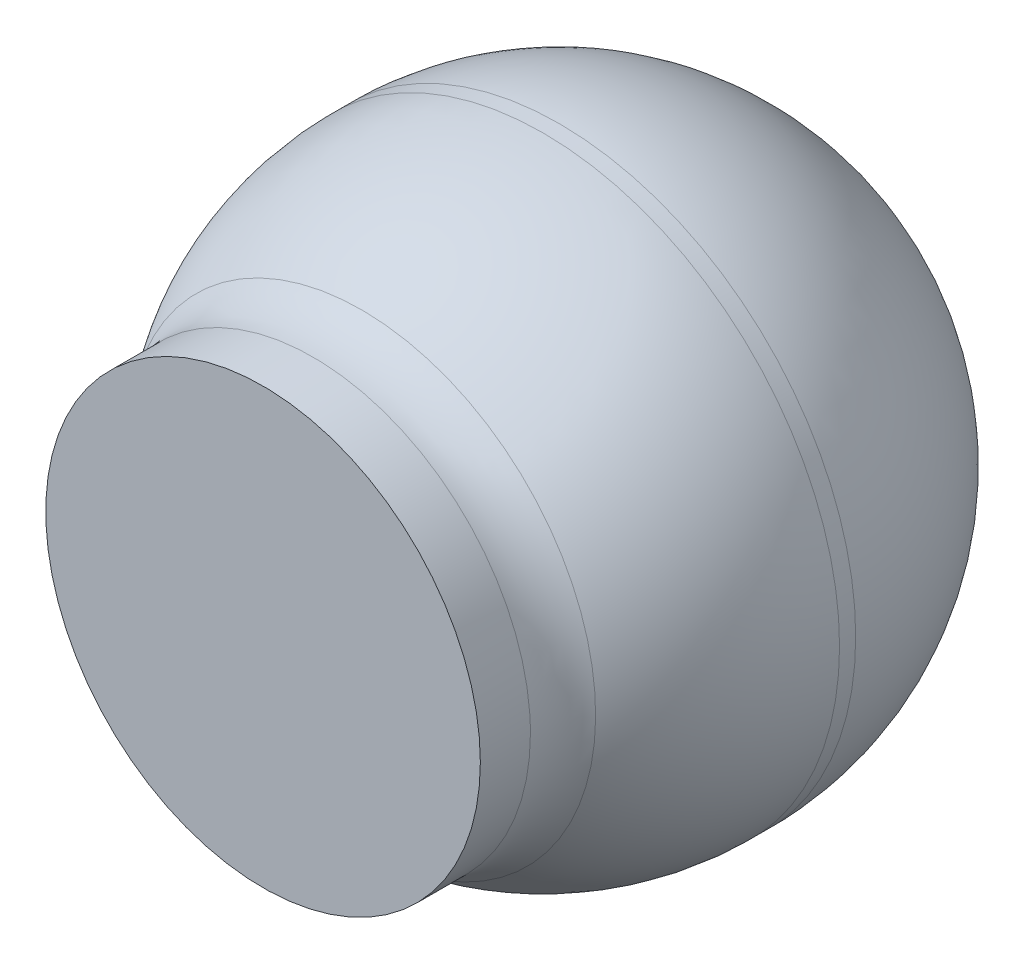
ISO-10303-21;
HEADER;
FILE_DESCRIPTION(('STEP AP214'),'2;1');
FILE_NAME('part.step','',(''),(''),'','','');
FILE_SCHEMA(('AUTOMOTIVE_DESIGN { 1 0 10303 214 1 1 1 1 }'));
ENDSEC;
DATA;
#1=APPLICATION_CONTEXT('core data for automotive mechanical design processes');
#2=APPLICATION_PROTOCOL_DEFINITION('international standard','automotive_design',2000,#1);
#3=PRODUCT_CONTEXT('',#1,'mechanical');
#4=PRODUCT('Part','Part','',(#3));
#5=PRODUCT_RELATED_PRODUCT_CATEGORY('part','',(#4));
#6=PRODUCT_DEFINITION_FORMATION('','',#4);
#7=PRODUCT_DEFINITION_CONTEXT('part definition',#1,'design');
#8=PRODUCT_DEFINITION('design','',#6,#7);
#9=PRODUCT_DEFINITION_SHAPE('','',#8);
#10=(LENGTH_UNIT() NAMED_UNIT(*) SI_UNIT(.MILLI.,.METRE.));
#11=(NAMED_UNIT(*) PLANE_ANGLE_UNIT() SI_UNIT($,.RADIAN.));
#12=(NAMED_UNIT(*) SI_UNIT($,.STERADIAN.) SOLID_ANGLE_UNIT());
#13=UNCERTAINTY_MEASURE_WITH_UNIT(LENGTH_MEASURE(1.E-05),#10,'distance_accuracy_value','');
#14=(GEOMETRIC_REPRESENTATION_CONTEXT(3) GLOBAL_UNCERTAINTY_ASSIGNED_CONTEXT((#13)) GLOBAL_UNIT_ASSIGNED_CONTEXT((#10,
#11,#12)) REPRESENTATION_CONTEXT('',''));
#15=CARTESIAN_POINT('',(0.,0.,0.));
#16=DIRECTION('',(0.,0.,1.));
#17=DIRECTION('',(1.,0.,0.));
#18=AXIS2_PLACEMENT_3D('',#15,#16,#17);
#19=CARTESIAN_POINT('',(-8.182919922269,-1.511349291452,10.006534503384));
#20=DIRECTION('',(0.,0.,-1.));
#21=DIRECTION('',(-1.,0.,0.));
#22=AXIS2_PLACEMENT_3D('',#19,#20,#21);
#23=PLANE('',#22);
#24=CARTESIAN_POINT('',(-8.182919922269,-1.511349291452,10.006534503384));
#25=DIRECTION('',(0.,0.,1.));
#26=DIRECTION('',(1.,0.,0.));
#27=AXIS2_PLACEMENT_3D('',#24,#25,#26);
#28=CIRCLE('',#27,0.275);
#29=CARTESIAN_POINT('',(-7.907919922269,-1.511349291452,10.006534503384));
#30=VERTEX_POINT('',#29);
#31=EDGE_CURVE('E20',#30,#30,#28,.F.);
#32=ORIENTED_EDGE('',*,*,#31,.F.);
#33=EDGE_LOOP('',(#32));
#34=FACE_BOUND('',#33,.T.);
#35=ADVANCED_FACE('F17',(#34),#23,.F.);
#36=CARTESIAN_POINT('',(-8.182919922269,-1.511349291452,9.906534503384));
#37=DIRECTION('',(0.,0.,1.));
#38=DIRECTION('',(1.,0.,0.));
#39=AXIS2_PLACEMENT_3D('',#36,#37,#38);
#40=CYLINDRICAL_SURFACE('',#39,0.275);
#41=CARTESIAN_POINT('',(-8.182919922269,-1.511349291452,9.943180457728));
#42=DIRECTION('',(0.,0.,-1.));
#43=DIRECTION('',(0.996700902337582,0.081162252799246,0.));
#44=AXIS2_PLACEMENT_3D('',#41,#42,#43);
#45=CIRCLE('',#44,0.275000000000001);
#46=CARTESIAN_POINT('',(-7.90882717412616,-1.48902967193221,9.943180457728));
#47=VERTEX_POINT('',#46);
#48=EDGE_CURVE('E65',#47,#47,#45,.F.);
#49=ORIENTED_EDGE('',*,*,#48,.T.);
#50=EDGE_LOOP('',(#49));
#51=FACE_BOUND('',#50,.T.);
#52=ORIENTED_EDGE('',*,*,#31,.T.);
#53=EDGE_LOOP('',(#52));
#54=FACE_BOUND('',#53,.T.);
#55=ADVANCED_FACE('F62',(#51,#54),#40,.T.);
#56=CARTESIAN_POINT('',(-8.182919922269,-1.511349291452,9.943180457728));
#57=DIRECTION('',(0.,0.,-1.));
#58=DIRECTION('',(0.996700902337583,0.081162252799246,0.));
#59=AXIS2_PLACEMENT_3D('',#56,#57,#58);
#60=TOROIDAL_SURFACE('',#59,0.375,0.1);
#61=ORIENTED_EDGE('',*,*,#48,.F.);
#62=EDGE_LOOP('',(#61));
#63=FACE_BOUND('',#62,.T.);
#64=CARTESIAN_POINT('',(-8.182919922269,-1.511349291452,9.881744931236));
#65=DIRECTION('',(0.,0.,-1.));
#66=DIRECTION('',(-0.996700902337597,-0.081162252799062,0.));
#67=AXIS2_PLACEMENT_3D('',#64,#65,#66);
#68=CIRCLE('',#67,0.296097046412663);
#69=CARTESIAN_POINT('',(-8.478040115608,-1.535381194786,9.881744931236));
#70=VERTEX_POINT('',#69);
#71=EDGE_CURVE('E39',#70,#70,#68,.T.);
#72=ORIENTED_EDGE('',*,*,#71,.F.);
#73=EDGE_LOOP('',(#72));
#74=FACE_BOUND('',#73,.T.);
#75=ADVANCED_FACE('F57',(#63,#74),#60,.F.);
#76=CARTESIAN_POINT('',(-8.556682760645,-1.541785136252,9.651976062157));
#77=CARTESIAN_POINT('',(-8.556682760645,-1.541785136252,9.701461392103));
#78=CARTESIAN_POINT('',(-8.548526217348,-1.541120941579,9.750947004335));
#79=CARTESIAN_POINT('',(-8.532207085349,-1.539792059952,9.798626332798));
#80=CARTESIAN_POINT('',(-8.508341390838,-1.537848654938,9.842699544317));
#81=CARTESIAN_POINT('',(-8.478040115608,-1.535381194786,9.881744931236));
#82=(BOUNDED_CURVE() B_SPLINE_CURVE(5,(#76,#77,#78,#79,#80,#81),.UNSPECIFIED.,.F.,
.F.) B_SPLINE_CURVE_WITH_KNOTS((6,6),(0.,0.661568582165),
.UNSPECIFIED.) CURVE() GEOMETRIC_REPRESENTATION_ITEM() RATIONAL_B_SPLINE_CURVE((1.,1.,1.,1.,1.,1.)) REPRESENTATION_ITEM(''));
#83=CARTESIAN_POINT('',(-8.182919922269,-1.511349291452,9.651976062157));
#84=DIRECTION('',(0.,0.,-1.));
#85=AXIS1_PLACEMENT('',#83,#84);
#86=SURFACE_OF_REVOLUTION('',#82,#85);
#87=CARTESIAN_POINT('',(-8.182919922269,-1.511349291452,9.651976062157));
#88=DIRECTION('',(0.,0.,1.));
#89=DIRECTION('',(1.,0.,0.));
#90=AXIS2_PLACEMENT_3D('',#87,#88,#89);
#91=CIRCLE('',#90,0.375);
#92=CARTESIAN_POINT('',(-7.807919922269,-1.511349291452,9.651976062157));
#93=VERTEX_POINT('',#92);
#94=EDGE_CURVE('E36',#93,#93,#91,.F.);
#95=ORIENTED_EDGE('',*,*,#94,.F.);
#96=EDGE_LOOP('',(#95));
#97=FACE_BOUND('',#96,.T.);
#98=ORIENTED_EDGE('',*,*,#71,.T.);
#99=EDGE_LOOP('',(#98));
#100=FACE_BOUND('',#99,.T.);
#101=ADVANCED_FACE('F53',(#97,#100),#86,.F.);
#102=CARTESIAN_POINT('',(-8.182919922269,-1.511349291452,9.256534503384));
#103=DIRECTION('',(0.,0.,1.));
#104=DIRECTION('',(1.,0.,0.));
#105=AXIS2_PLACEMENT_3D('',#102,#103,#104);
#106=CYLINDRICAL_SURFACE('',#105,0.375);
#107=CARTESIAN_POINT('',(-8.182919922269,-1.511349291452,9.631534503384));
#108=DIRECTION('',(0.,0.,-1.));
#109=DIRECTION('',(0.0811622527992356,-0.996700902337583,0.));
#110=AXIS2_PLACEMENT_3D('',#107,#108,#109);
#111=CIRCLE('',#110,0.375);
#112=CARTESIAN_POINT('',(-8.15248407746929,-1.88511212982859,9.631534503384));
#113=VERTEX_POINT('',#112);
#114=CARTESIAN_POINT('',(-8.21335576706871,-1.13758645307541,9.631534503384));
#115=VERTEX_POINT('',#114);
#116=EDGE_CURVE('E11',#113,#115,#111,.T.);
#117=ORIENTED_EDGE('',*,*,#116,.F.);
#118=CARTESIAN_POINT('',(-8.182919922269,-1.511349291452,9.631534503384));
#119=DIRECTION('',(3.33436315446763E-12,2.72100352061447E-13,1.));
#120=DIRECTION('',(0.0811622527992365,-0.996700902337583,0.));
#121=AXIS2_PLACEMENT_3D('',#118,#119,#120);
#122=CIRCLE('',#121,0.375);
#123=EDGE_CURVE('E25',#115,#113,#122,.F.);
#124=ORIENTED_EDGE('',*,*,#123,.F.);
#125=EDGE_LOOP('',(#117,#124));
#126=FACE_BOUND('',#125,.T.);
#127=ORIENTED_EDGE('',*,*,#94,.T.);
#128=EDGE_LOOP('',(#127));
#129=FACE_BOUND('',#128,.T.);
#130=ADVANCED_FACE('F34',(#126,#129),#106,.T.);
#131=CARTESIAN_POINT('',(-8.182919922269,-1.511349291452,9.631534503384));
#132=DIRECTION('',(0.0811622527992361,-0.996700902337583,0.));
#133=DIRECTION('',(-0.996700902337583,-0.0811622527992361,0.));
#134=AXIS2_PLACEMENT_3D('',#131,#132,#133);
#135=SPHERICAL_SURFACE('',#134,0.375);
#136=ORIENTED_EDGE('',*,*,#123,.T.);
#137=ORIENTED_EDGE('',*,*,#116,.T.);
#138=EDGE_LOOP('',(#136,#137));
#139=FACE_BOUND('',#138,.T.);
#140=ADVANCED_FACE('F32',(#139),#135,.T.);
#141=CLOSED_SHELL('',(#35,#55,#75,#101,#130,#140));
#142=MANIFOLD_SOLID_BREP('B1',#141);
#143=ADVANCED_BREP_SHAPE_REPRESENTATION('',(#18,#142),#14);
#144=SHAPE_DEFINITION_REPRESENTATION(#9,#143);
ENDSEC;
END-ISO-10303-21;
